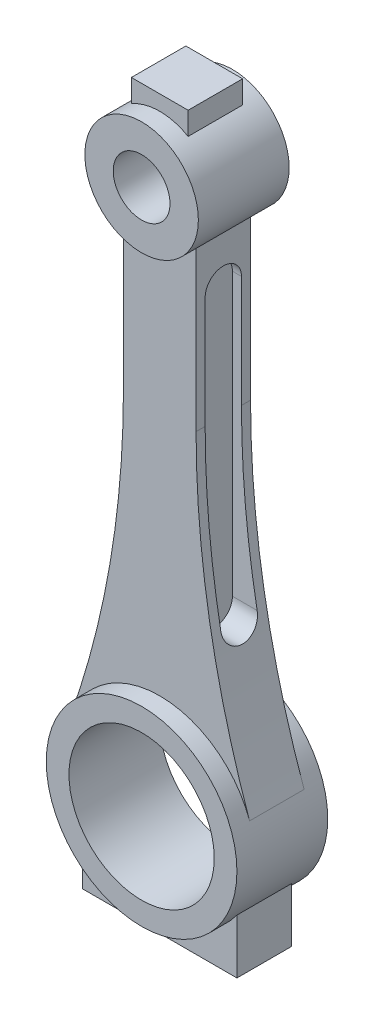
ISO-10303-21;
HEADER;
FILE_DESCRIPTION(('STEP AP214'),'2;1');
FILE_NAME('part.step','',(''),(''),'','','');
FILE_SCHEMA(('AUTOMOTIVE_DESIGN { 1 0 10303 214 1 1 1 1 }'));
ENDSEC;
DATA;
#1=APPLICATION_CONTEXT('core data for automotive mechanical design processes');
#2=APPLICATION_PROTOCOL_DEFINITION('international standard','automotive_design',2000,#1);
#3=PRODUCT_CONTEXT('',#1,'mechanical');
#4=PRODUCT('Part','Part','',(#3));
#5=PRODUCT_RELATED_PRODUCT_CATEGORY('part','',(#4));
#6=PRODUCT_DEFINITION_FORMATION('','',#4);
#7=PRODUCT_DEFINITION_CONTEXT('part definition',#1,'design');
#8=PRODUCT_DEFINITION('design','',#6,#7);
#9=PRODUCT_DEFINITION_SHAPE('','',#8);
#10=(LENGTH_UNIT() NAMED_UNIT(*) SI_UNIT(.MILLI.,.METRE.));
#11=(NAMED_UNIT(*) PLANE_ANGLE_UNIT() SI_UNIT($,.RADIAN.));
#12=(NAMED_UNIT(*) SI_UNIT($,.STERADIAN.) SOLID_ANGLE_UNIT());
#13=UNCERTAINTY_MEASURE_WITH_UNIT(LENGTH_MEASURE(1.E-05),#10,'distance_accuracy_value','');
#14=(GEOMETRIC_REPRESENTATION_CONTEXT(3) GLOBAL_UNCERTAINTY_ASSIGNED_CONTEXT((#13)) GLOBAL_UNIT_ASSIGNED_CONTEXT((#10,
#11,#12)) REPRESENTATION_CONTEXT('',''));
#15=CARTESIAN_POINT('',(0.,0.,0.));
#16=DIRECTION('',(0.,0.,1.));
#17=DIRECTION('',(1.,0.,0.));
#18=AXIS2_PLACEMENT_3D('',#15,#16,#17);
#19=CARTESIAN_POINT('',(212.132819979024,75.3953136438508,6.));
#20=DIRECTION('',(0.,0.,-1.));
#21=DIRECTION('',(-1.,0.,0.));
#22=AXIS2_PLACEMENT_3D('',#19,#20,#21);
#23=CYLINDRICAL_SURFACE('',#22,204.132819979024);
#24=CARTESIAN_POINT('',(11.4544735884215,38.,-4.00000000000001));
#25=CARTESIAN_POINT('',(11.4757515518411,37.8858086335559,-4.00000967356236));
#26=CARTESIAN_POINT('',(11.4971278489319,37.7716411229782,-3.9951101211208));
#27=CARTESIAN_POINT('',(11.5399210356049,37.544152772884,-3.97557755361705));
#28=CARTESIAN_POINT('',(11.5613379239584,37.4308319082382,-3.9609448286138));
#29=CARTESIAN_POINT('',(11.6040518019029,37.2058589467753,-3.92203609087539));
#30=CARTESIAN_POINT('',(11.6253488219803,37.0942064124742,-3.89776265395078));
#31=CARTESIAN_POINT('',(11.6676599337569,36.8733657612217,-3.83975872762631));
#32=CARTESIAN_POINT('',(11.6886740293759,36.7641776101131,-3.80602836938937));
#33=CARTESIAN_POINT('',(11.7510730473326,36.4413470108117,-3.69089420326938));
#34=CARTESIAN_POINT('',(11.7918289081029,36.2323636826891,-3.59553432969807));
#35=CARTESIAN_POINT('',(11.8702126062764,35.833491871712,-3.37027556179513));
#36=CARTESIAN_POINT('',(11.9078413597511,35.643597793309,-3.24038682968163));
#37=CARTESIAN_POINT('',(11.9784728244352,35.2894796680367,-2.950436910244));
#38=CARTESIAN_POINT('',(12.0115036519544,35.1250988255321,-2.79057453802655));
#39=CARTESIAN_POINT('',(12.0720036427705,34.8256035029566,-2.44449926104124));
#40=CARTESIAN_POINT('',(12.0994724370193,34.6904909648341,-2.25828460915733));
#41=CARTESIAN_POINT('',(12.1473413477104,34.4559602912754,-1.86832249559897));
#42=CARTESIAN_POINT('',(12.1678582991114,34.3559510460777,-1.66494499104501));
#43=CARTESIAN_POINT('',(12.201667760202,34.1915558050773,-1.24372237948288));
#44=CARTESIAN_POINT('',(12.2149615713728,34.1271633917176,-1.02587988675161));
#45=CARTESIAN_POINT('',(12.2336033492388,34.0369591960168,-0.586274812122707));
#46=CARTESIAN_POINT('',(12.2390950212481,34.0104496060439,-0.364661335561857));
#47=CARTESIAN_POINT('',(12.2423732155318,33.9946184843632,0.0799443502249413));
#48=CARTESIAN_POINT('',(12.2401601145853,34.0052951341723,0.302936491499036));
#49=CARTESIAN_POINT('',(12.2281765408432,34.0632127244266,0.741781925824315));
#50=CARTESIAN_POINT('',(12.2184766498272,34.1101121767816,0.957682365575701));
#51=CARTESIAN_POINT('',(12.1919895794175,34.2385791029979,1.37844153266758));
#52=CARTESIAN_POINT('',(12.1752023313576,34.3201469127454,1.58330015300714));
#53=CARTESIAN_POINT('',(12.1350793834177,34.5159552856904,1.977397761575));
#54=CARTESIAN_POINT('',(12.1117098081663,34.6303649264094,2.16654921549123));
#55=CARTESIAN_POINT('',(12.0593260749273,34.8882465100265,2.52297125984127));
#56=CARTESIAN_POINT('',(12.0303117725959,35.0317191961119,2.69024129055298));
#57=CARTESIAN_POINT('',(11.9671383735568,35.3461665633751,3.00114206510914));
#58=CARTESIAN_POINT('',(11.9329025496515,35.5175545383741,3.14433904981939));
#59=CARTESIAN_POINT('',(11.8607975408037,35.8812712267655,3.40006280722765));
#60=CARTESIAN_POINT('',(11.8229268395297,36.0736086840292,3.51257670427656));
#61=CARTESIAN_POINT('',(11.744011046999,36.4777513253325,3.70593438635491));
#62=CARTESIAN_POINT('',(11.7029182624971,36.6898643551292,3.78611370956408));
#63=CARTESIAN_POINT('',(11.6195357198389,37.1241795414682,3.90944320644274));
#64=CARTESIAN_POINT('',(11.5772477716993,37.3463667203578,3.95264656840454));
#65=CARTESIAN_POINT('',(11.5215540274852,37.6417241762258,3.98457340087694));
#66=CARTESIAN_POINT('',(11.5080944382148,37.713314753212,3.99036111817268));
#67=CARTESIAN_POINT('',(11.481236818834,37.8565916807734,3.99806924003837));
#68=CARTESIAN_POINT('',(11.4678387235409,37.9282776734255,3.99999606757804));
#69=CARTESIAN_POINT('',(11.4544735884215,38.,3.99999999999999));
#70=B_SPLINE_CURVE_WITH_KNOTS('',3,(#24,#25,#26,#27,#28,#29,#30,#31,#32,#33,#34,#35,#36,#37,#38,
#39,#40,#41,#42,#43,#44,#45,#46,#47,#48,#49,#50,#51,#52,#53,#54,#55,#56,#57,#58,#59,#60,#61,#62,
#63,#64,#65,#66,#67,#68,#69),.UNSPECIFIED.,.F.,.F.,(4,2,2,2,2,2,2,2,2,2,2,2,2,2,2,2,2,2,2,2,2,2,
4),(0.,0.348357600629776,0.696704820295751,1.04495903090801,1.39320841164155,2.08947857427322,
2.78554404346984,3.47714614167073,4.1687941135383,4.84816302804556,5.52740949173436,
6.19397531687089,6.86050854603356,7.52083364695975,8.18116514562694,8.84495910470898,
9.50877004017901,10.1834922182609,10.8584970981523,11.546741507572,12.2339942357506,
12.4531452672714,12.6719314158043),.UNSPECIFIED.);
#71=CARTESIAN_POINT('',(11.4544735884215,38.,-4.00000000000001));
#72=VERTEX_POINT('',#71);
#73=CARTESIAN_POINT('',(11.4544735884215,38.,3.99999999999999));
#74=VERTEX_POINT('',#73);
#75=EDGE_CURVE('E11',#72,#74,#70,.T.);
#76=ORIENTED_EDGE('',*,*,#75,.T.);
#77=CARTESIAN_POINT('',(212.132819979024,75.3953136438508,4.));
#78=DIRECTION('',(0.,0.,-1.));
#79=DIRECTION('',(0.,1.,0.));
#80=AXIS2_PLACEMENT_3D('',#77,#78,#79);
#81=CIRCLE('',#80,204.132819979024);
#82=CARTESIAN_POINT('',(8.00000000000001,75.3953136438507,4.));
#83=VERTEX_POINT('',#82);
#84=EDGE_CURVE('E252',#74,#83,#81,.T.);
#85=ORIENTED_EDGE('',*,*,#84,.T.);
#86=DIRECTION('',(0.,0.,-1.));
#87=VECTOR('',#86,1.);
#88=CARTESIAN_POINT('',(8.00000000000001,75.3953136438507,6.));
#89=LINE('',#88,#87);
#90=CARTESIAN_POINT('',(8.00000000000001,75.3953136438507,6.));
#91=VERTEX_POINT('',#90);
#92=EDGE_CURVE('E443',#91,#83,#89,.T.);
#93=ORIENTED_EDGE('',*,*,#92,.F.);
#94=CARTESIAN_POINT('',(212.132819979024,75.3953136438508,6.));
#95=DIRECTION('',(0.,0.,1.));
#96=DIRECTION('',(1.,0.,0.));
#97=AXIS2_PLACEMENT_3D('',#94,#95,#96);
#98=CIRCLE('',#97,204.132819979024);
#99=CARTESIAN_POINT('',(19.7873824881444,7.03274443356766,6.));
#100=VERTEX_POINT('',#99);
#101=EDGE_CURVE('E409',#91,#100,#98,.T.);
#102=ORIENTED_EDGE('',*,*,#101,.T.);
#103=DIRECTION('',(0.,0.,-1.));
#104=VECTOR('',#103,1.);
#105=CARTESIAN_POINT('',(19.7873824881444,7.03274443356765,6.));
#106=LINE('',#105,#104);
#107=CARTESIAN_POINT('',(19.7873824881444,7.03274443356766,-6.));
#108=VERTEX_POINT('',#107);
#109=EDGE_CURVE('E447',#100,#108,#106,.T.);
#110=ORIENTED_EDGE('',*,*,#109,.T.);
#111=CARTESIAN_POINT('',(212.132819979024,75.3953136438508,-6.));
#112=DIRECTION('',(0.,0.,1.));
#113=DIRECTION('',(1.,0.,0.));
#114=AXIS2_PLACEMENT_3D('',#111,#112,#113);
#115=CIRCLE('',#114,204.132819979024);
#116=CARTESIAN_POINT('',(8.00000000000001,75.3953136438507,-6.));
#117=VERTEX_POINT('',#116);
#118=EDGE_CURVE('E433',#117,#108,#115,.T.);
#119=ORIENTED_EDGE('',*,*,#118,.F.);
#120=CARTESIAN_POINT('',(8.00000000000001,75.3953136438507,-4.00000000000001));
#121=VERTEX_POINT('',#120);
#122=EDGE_CURVE('E442',#121,#117,#89,.T.);
#123=ORIENTED_EDGE('',*,*,#122,.F.);
#124=CARTESIAN_POINT('',(212.132819979024,75.3953136438508,-4.00000000000001));
#125=DIRECTION('',(0.,0.,1.));
#126=DIRECTION('',(0.,-1.,0.));
#127=AXIS2_PLACEMENT_3D('',#124,#125,#126);
#128=CIRCLE('',#127,204.132819979024);
#129=EDGE_CURVE('E61',#121,#72,#128,.T.);
#130=ORIENTED_EDGE('',*,*,#129,.T.);
#131=EDGE_LOOP('',(#76,#85,#93,#102,#110,#119,#123,#130));
#132=FACE_BOUND('',#131,.T.);
#133=ADVANCED_FACE('F39',(#132),#23,.F.);
#134=CARTESIAN_POINT('',(8.00000000000003,0.,6.));
#135=DIRECTION('',(-1.,0.,0.));
#136=DIRECTION('',(0.,-1.,0.));
#137=AXIS2_PLACEMENT_3D('',#134,#135,#136);
#138=PLANE('',#137);
#139=DIRECTION('',(0.,-1.,0.));
#140=VECTOR('',#139,1.);
#141=CARTESIAN_POINT('',(8.00000000000003,0.,3.99999999999999));
#142=LINE('',#141,#140);
#143=CARTESIAN_POINT('',(8.00000000000001,100.,4.));
#144=VERTEX_POINT('',#143);
#145=EDGE_CURVE('E54',#144,#83,#142,.T.);
#146=ORIENTED_EDGE('',*,*,#145,.F.);
#147=CARTESIAN_POINT('',(8.,100.,0.));
#148=DIRECTION('',(-1.,0.,0.));
#149=DIRECTION('',(0.,-1.,0.));
#150=AXIS2_PLACEMENT_3D('',#147,#148,#149);
#151=CIRCLE('',#150,4.);
#152=CARTESIAN_POINT('',(8.00000000000001,100.,-4.));
#153=VERTEX_POINT('',#152);
#154=EDGE_CURVE('E215',#153,#144,#151,.F.);
#155=ORIENTED_EDGE('',*,*,#154,.F.);
#156=DIRECTION('',(0.,1.,0.));
#157=VECTOR('',#156,1.);
#158=CARTESIAN_POINT('',(8.00000000000003,0.,-4.00000000000002));
#159=LINE('',#158,#157);
#160=EDGE_CURVE('E590',#121,#153,#159,.T.);
#161=ORIENTED_EDGE('',*,*,#160,.F.);
#162=ORIENTED_EDGE('',*,*,#122,.T.);
#163=DIRECTION('',(0.,1.,0.));
#164=VECTOR('',#163,1.);
#165=CARTESIAN_POINT('',(8.00000000000003,0.,-6.));
#166=LINE('',#165,#164);
#167=CARTESIAN_POINT('',(8.,110.395313643851,-6.));
#168=VERTEX_POINT('',#167);
#169=EDGE_CURVE('E398',#117,#168,#166,.T.);
#170=ORIENTED_EDGE('',*,*,#169,.T.);
#171=DIRECTION('',(0.,0.,-1.));
#172=VECTOR('',#171,1.);
#173=CARTESIAN_POINT('',(8.,110.395313643851,6.));
#174=LINE('',#173,#172);
#175=CARTESIAN_POINT('',(8.,110.395313643851,6.));
#176=VERTEX_POINT('',#175);
#177=EDGE_CURVE('E417',#176,#168,#174,.T.);
#178=ORIENTED_EDGE('',*,*,#177,.F.);
#179=DIRECTION('',(0.,1.,0.));
#180=VECTOR('',#179,1.);
#181=CARTESIAN_POINT('',(8.00000000000003,0.,6.));
#182=LINE('',#181,#180);
#183=EDGE_CURVE('E413',#91,#176,#182,.T.);
#184=ORIENTED_EDGE('',*,*,#183,.F.);
#185=ORIENTED_EDGE('',*,*,#92,.T.);
#186=EDGE_LOOP('',(#146,#155,#161,#162,#170,#178,#184,#185));
#187=FACE_BOUND('',#186,.T.);
#188=ADVANCED_FACE('F578',(#187),#138,.F.);
#189=CARTESIAN_POINT('',(0.,120.,10.));
#190=DIRECTION('',(0.,0.,-1.));
#191=DIRECTION('',(-1.,0.,0.));
#192=AXIS2_PLACEMENT_3D('',#189,#190,#191);
#193=CYLINDRICAL_SURFACE('',#192,6.25);
#194=CARTESIAN_POINT('',(0.,120.,10.));
#195=DIRECTION('',(0.,0.,1.));
#196=DIRECTION('',(1.,0.,0.));
#197=AXIS2_PLACEMENT_3D('',#194,#195,#196);
#198=CIRCLE('',#197,6.25);
#199=CARTESIAN_POINT('',(6.25,120.,10.));
#200=VERTEX_POINT('',#199);
#201=EDGE_CURVE('E464',#200,#200,#198,.T.);
#202=ORIENTED_EDGE('',*,*,#201,.T.);
#203=EDGE_LOOP('',(#202));
#204=FACE_BOUND('',#203,.T.);
#205=CARTESIAN_POINT('',(0.,120.,-10.));
#206=DIRECTION('',(0.,0.,1.));
#207=DIRECTION('',(1.,0.,0.));
#208=AXIS2_PLACEMENT_3D('',#205,#206,#207);
#209=CIRCLE('',#208,6.25);
#210=CARTESIAN_POINT('',(6.25,120.,-10.));
#211=VERTEX_POINT('',#210);
#212=EDGE_CURVE('E463',#211,#211,#209,.T.);
#213=ORIENTED_EDGE('',*,*,#212,.F.);
#214=EDGE_LOOP('',(#213));
#215=FACE_BOUND('',#214,.T.);
#216=ADVANCED_FACE('F41',(#204,#215),#193,.F.);
#217=CARTESIAN_POINT('',(0.,120.,10.));
#218=DIRECTION('',(0.,0.,-1.));
#219=DIRECTION('',(-1.,0.,0.));
#220=AXIS2_PLACEMENT_3D('',#217,#218,#219);
#221=CYLINDRICAL_SURFACE('',#220,12.5);
#222=DIRECTION('',(0.,0.,-1.));
#223=VECTOR('',#222,1.);
#224=CARTESIAN_POINT('',(6.25,130.825317547305,6.));
#225=LINE('',#224,#223);
#226=CARTESIAN_POINT('',(6.25,130.825317547305,6.));
#227=VERTEX_POINT('',#226);
#228=CARTESIAN_POINT('',(6.25,130.825317547305,-6.));
#229=VERTEX_POINT('',#228);
#230=EDGE_CURVE('E373',#227,#229,#225,.T.);
#231=ORIENTED_EDGE('',*,*,#230,.F.);
#232=CARTESIAN_POINT('',(0.,120.,6.));
#233=DIRECTION('',(0.,0.,1.));
#234=DIRECTION('',(1.,0.,0.));
#235=AXIS2_PLACEMENT_3D('',#232,#233,#234);
#236=CIRCLE('',#235,12.5);
#237=CARTESIAN_POINT('',(-6.25,130.825317547305,6.));
#238=VERTEX_POINT('',#237);
#239=EDGE_CURVE('E334',#227,#238,#236,.T.);
#240=ORIENTED_EDGE('',*,*,#239,.T.);
#241=DIRECTION('',(0.,0.,-1.));
#242=VECTOR('',#241,1.);
#243=CARTESIAN_POINT('',(-6.25,130.825317547305,6.));
#244=LINE('',#243,#242);
#245=CARTESIAN_POINT('',(-6.25,130.825317547305,-6.));
#246=VERTEX_POINT('',#245);
#247=EDGE_CURVE('E350',#238,#246,#244,.T.);
#248=ORIENTED_EDGE('',*,*,#247,.T.);
#249=CARTESIAN_POINT('',(0.,120.,-6.));
#250=DIRECTION('',(0.,0.,1.));
#251=DIRECTION('',(1.,0.,0.));
#252=AXIS2_PLACEMENT_3D('',#249,#250,#251);
#253=CIRCLE('',#252,12.5);
#254=EDGE_CURVE('E333',#229,#246,#253,.T.);
#255=ORIENTED_EDGE('',*,*,#254,.F.);
#256=EDGE_LOOP('',(#231,#240,#248,#255));
#257=FACE_BOUND('',#256,.T.);
#258=DIRECTION('',(0.,0.,-1.));
#259=VECTOR('',#258,1.);
#260=CARTESIAN_POINT('',(-7.99999999999999,110.395313643851,6.));
#261=LINE('',#260,#259);
#262=CARTESIAN_POINT('',(-7.99999999999999,110.395313643851,6.));
#263=VERTEX_POINT('',#262);
#264=CARTESIAN_POINT('',(-7.99999999999999,110.395313643851,-6.));
#265=VERTEX_POINT('',#264);
#266=EDGE_CURVE('E459',#263,#265,#261,.T.);
#267=ORIENTED_EDGE('',*,*,#266,.F.);
#268=CARTESIAN_POINT('',(0.,120.,6.));
#269=DIRECTION('',(0.,0.,1.));
#270=DIRECTION('',(1.,0.,0.));
#271=AXIS2_PLACEMENT_3D('',#268,#269,#270);
#272=CIRCLE('',#271,12.5);
#273=EDGE_CURVE('E394',#263,#176,#272,.T.);
#274=ORIENTED_EDGE('',*,*,#273,.T.);
#275=ORIENTED_EDGE('',*,*,#177,.T.);
#276=CARTESIAN_POINT('',(0.,120.,-6.));
#277=DIRECTION('',(0.,0.,1.));
#278=DIRECTION('',(1.,0.,0.));
#279=AXIS2_PLACEMENT_3D('',#276,#277,#278);
#280=CIRCLE('',#279,12.5);
#281=EDGE_CURVE('E387',#265,#168,#280,.T.);
#282=ORIENTED_EDGE('',*,*,#281,.F.);
#283=EDGE_LOOP('',(#267,#274,#275,#282));
#284=FACE_BOUND('',#283,.T.);
#285=CARTESIAN_POINT('',(0.,120.,10.));
#286=DIRECTION('',(0.,0.,1.));
#287=DIRECTION('',(1.,0.,0.));
#288=AXIS2_PLACEMENT_3D('',#285,#286,#287);
#289=CIRCLE('',#288,12.5);
#290=CARTESIAN_POINT('',(12.5,120.,10.));
#291=VERTEX_POINT('',#290);
#292=EDGE_CURVE('E468',#291,#291,#289,.T.);
#293=ORIENTED_EDGE('',*,*,#292,.F.);
#294=EDGE_LOOP('',(#293));
#295=FACE_BOUND('',#294,.T.);
#296=CARTESIAN_POINT('',(0.,120.,-10.));
#297=DIRECTION('',(0.,0.,1.));
#298=DIRECTION('',(1.,0.,0.));
#299=AXIS2_PLACEMENT_3D('',#296,#297,#298);
#300=CIRCLE('',#299,12.5);
#301=CARTESIAN_POINT('',(12.5,120.,-10.));
#302=VERTEX_POINT('',#301);
#303=EDGE_CURVE('E469',#302,#302,#300,.T.);
#304=ORIENTED_EDGE('',*,*,#303,.T.);
#305=EDGE_LOOP('',(#304));
#306=FACE_BOUND('',#305,.T.);
#307=ADVANCED_FACE('F864',(#257,#284,#295,#306),#221,.T.);
#308=CARTESIAN_POINT('',(0.,0.,10.));
#309=DIRECTION('',(0.,0.,1.));
#310=DIRECTION('',(1.,0.,0.));
#311=AXIS2_PLACEMENT_3D('',#308,#309,#310);
#312=PLANE('',#311);
#313=ORIENTED_EDGE('',*,*,#201,.F.);
#314=EDGE_LOOP('',(#313));
#315=FACE_BOUND('',#314,.T.);
#316=ORIENTED_EDGE('',*,*,#292,.T.);
#317=EDGE_LOOP('',(#316));
#318=FACE_BOUND('',#317,.T.);
#319=ADVANCED_FACE('F852',(#315,#318),#312,.T.);
#320=CARTESIAN_POINT('',(0.,0.,-10.));
#321=DIRECTION('',(0.,0.,1.));
#322=DIRECTION('',(1.,0.,0.));
#323=AXIS2_PLACEMENT_3D('',#320,#321,#322);
#324=PLANE('',#323);
#325=ORIENTED_EDGE('',*,*,#212,.T.);
#326=EDGE_LOOP('',(#325));
#327=FACE_BOUND('',#326,.T.);
#328=ORIENTED_EDGE('',*,*,#303,.F.);
#329=EDGE_LOOP('',(#328));
#330=FACE_BOUND('',#329,.T.);
#331=ADVANCED_FACE('F728',(#327,#330),#324,.F.);
#332=CARTESIAN_POINT('',(-7.99999999999999,0.,6.));
#333=DIRECTION('',(-1.,0.,0.));
#334=DIRECTION('',(0.,0.,1.));
#335=AXIS2_PLACEMENT_3D('',#332,#333,#334);
#336=PLANE('',#335);
#337=DIRECTION('',(0.,-1.,0.));
#338=VECTOR('',#337,1.);
#339=CARTESIAN_POINT('',(-7.99999999999999,0.,-4.00000000000002));
#340=LINE('',#339,#338);
#341=CARTESIAN_POINT('',(-8.,100.,-4.));
#342=VERTEX_POINT('',#341);
#343=CARTESIAN_POINT('',(-7.99999999999995,75.3953136438507,-4.00000000000001));
#344=VERTEX_POINT('',#343);
#345=EDGE_CURVE('E285',#342,#344,#340,.T.);
#346=ORIENTED_EDGE('',*,*,#345,.F.);
#347=CARTESIAN_POINT('',(-7.99999999999999,100.,0.));
#348=DIRECTION('',(-1.,0.,0.));
#349=DIRECTION('',(0.,0.,1.));
#350=AXIS2_PLACEMENT_3D('',#347,#348,#349);
#351=CIRCLE('',#350,4.);
#352=CARTESIAN_POINT('',(-8.,100.,4.));
#353=VERTEX_POINT('',#352);
#354=EDGE_CURVE('E595',#353,#342,#351,.T.);
#355=ORIENTED_EDGE('',*,*,#354,.F.);
#356=DIRECTION('',(0.,1.,0.));
#357=VECTOR('',#356,1.);
#358=CARTESIAN_POINT('',(-7.99999999999999,0.,3.99999999999999));
#359=LINE('',#358,#357);
#360=CARTESIAN_POINT('',(-7.99999999999995,75.3953136438507,4.));
#361=VERTEX_POINT('',#360);
#362=EDGE_CURVE('E275',#361,#353,#359,.T.);
#363=ORIENTED_EDGE('',*,*,#362,.F.);
#364=DIRECTION('',(0.,0.,-1.));
#365=VECTOR('',#364,1.);
#366=CARTESIAN_POINT('',(-7.99999999999999,75.3953136438507,6.));
#367=LINE('',#366,#365);
#368=CARTESIAN_POINT('',(-7.99999999999999,75.3953136438507,6.));
#369=VERTEX_POINT('',#368);
#370=EDGE_CURVE('E455',#369,#361,#367,.T.);
#371=ORIENTED_EDGE('',*,*,#370,.F.);
#372=DIRECTION('',(0.,1.,0.));
#373=VECTOR('',#372,1.);
#374=CARTESIAN_POINT('',(-7.99999999999999,0.,6.));
#375=LINE('',#374,#373);
#376=EDGE_CURVE('E397',#369,#263,#375,.T.);
#377=ORIENTED_EDGE('',*,*,#376,.T.);
#378=ORIENTED_EDGE('',*,*,#266,.T.);
#379=DIRECTION('',(0.,1.,0.));
#380=VECTOR('',#379,1.);
#381=CARTESIAN_POINT('',(-7.99999999999999,0.,-6.));
#382=LINE('',#381,#380);
#383=CARTESIAN_POINT('',(-7.99999999999999,75.3953136438507,-6.));
#384=VERTEX_POINT('',#383);
#385=EDGE_CURVE('E421',#384,#265,#382,.T.);
#386=ORIENTED_EDGE('',*,*,#385,.F.);
#387=EDGE_CURVE('E454',#344,#384,#367,.T.);
#388=ORIENTED_EDGE('',*,*,#387,.F.);
#389=EDGE_LOOP('',(#346,#355,#363,#371,#377,#378,#386,#388));
#390=FACE_BOUND('',#389,.T.);
#391=ADVANCED_FACE('F611',(#390),#336,.T.);
#392=CARTESIAN_POINT('',(-212.132819979024,75.3953136438507,6.));
#393=DIRECTION('',(0.,0.,-1.));
#394=DIRECTION('',(-1.,0.,0.));
#395=AXIS2_PLACEMENT_3D('',#392,#393,#394);
#396=CYLINDRICAL_SURFACE('',#395,204.132819979024);
#397=CARTESIAN_POINT('',(-11.4544735884215,38.,3.99999999999999));
#398=CARTESIAN_POINT('',(-11.4757515518411,37.8858086335559,4.00000967356234));
#399=CARTESIAN_POINT('',(-11.497127848932,37.7716411229782,3.99511012112078));
#400=CARTESIAN_POINT('',(-11.5399210356049,37.544152772884,3.97557755361703));
#401=CARTESIAN_POINT('',(-11.5613379239584,37.4308319082382,3.96094482861378));
#402=CARTESIAN_POINT('',(-11.6040518019029,37.2058589467753,3.92203609087537));
#403=CARTESIAN_POINT('',(-11.6253488219802,37.0942064124742,3.89776265395076));
#404=CARTESIAN_POINT('',(-11.6676599337569,36.8733657612217,3.83975872762629));
#405=CARTESIAN_POINT('',(-11.6886740293759,36.7641776101131,3.80602836938935));
#406=CARTESIAN_POINT('',(-11.7510730473326,36.4413470108117,3.69089420326936));
#407=CARTESIAN_POINT('',(-11.7918289081029,36.2323636826891,3.59553432969806));
#408=CARTESIAN_POINT('',(-11.8702126062764,35.833491871712,3.37027556179512));
#409=CARTESIAN_POINT('',(-11.9078413597511,35.643597793309,3.24038682968161));
#410=CARTESIAN_POINT('',(-11.9784728244352,35.2894796680367,2.95043691024398));
#411=CARTESIAN_POINT('',(-12.0115036519544,35.1250988255321,2.79057453802653));
#412=CARTESIAN_POINT('',(-12.0720036427705,34.8256035029566,2.44449926104122));
#413=CARTESIAN_POINT('',(-12.0994724370193,34.6904909648341,2.25828460915731));
#414=CARTESIAN_POINT('',(-12.1473413477104,34.4559602912754,1.86832249559894));
#415=CARTESIAN_POINT('',(-12.1678582991115,34.3559510460777,1.66494499104499));
#416=CARTESIAN_POINT('',(-12.201667760202,34.1915558050773,1.24372237948285));
#417=CARTESIAN_POINT('',(-12.2149615713728,34.1271633917176,1.02587988675158));
#418=CARTESIAN_POINT('',(-12.2336033492387,34.0369591960168,0.586274812122681));
#419=CARTESIAN_POINT('',(-12.2390950212481,34.0104496060439,0.364661335561831));
#420=CARTESIAN_POINT('',(-12.2423732155318,33.9946184843632,-0.0799443502249659));
#421=CARTESIAN_POINT('',(-12.2401601145852,34.0052951341723,-0.302936491499059));
#422=CARTESIAN_POINT('',(-12.2281765408432,34.0632127244266,-0.74178192582434));
#423=CARTESIAN_POINT('',(-12.2184766498272,34.1101121767816,-0.957682365575728));
#424=CARTESIAN_POINT('',(-12.1919895794175,34.2385791029979,-1.37844153266761));
#425=CARTESIAN_POINT('',(-12.1752023313576,34.3201469127454,-1.58330015300717));
#426=CARTESIAN_POINT('',(-12.1350793834177,34.5159552856904,-1.97739776157503));
#427=CARTESIAN_POINT('',(-12.1117098081663,34.6303649264094,-2.16654921549125));
#428=CARTESIAN_POINT('',(-12.0593260749272,34.8882465100265,-2.52297125984129));
#429=CARTESIAN_POINT('',(-12.0303117725959,35.0317191961119,-2.69024129055301));
#430=CARTESIAN_POINT('',(-11.9671383735568,35.3461665633751,-3.00114206510916));
#431=CARTESIAN_POINT('',(-11.9329025496515,35.5175545383741,-3.14433904981941));
#432=CARTESIAN_POINT('',(-11.8607975408037,35.8812712267655,-3.40006280722767));
#433=CARTESIAN_POINT('',(-11.8229268395297,36.0736086840292,-3.51257670427658));
#434=CARTESIAN_POINT('',(-11.744011046999,36.4777513253325,-3.70593438635493));
#435=CARTESIAN_POINT('',(-11.702918262497,36.6898643551292,-3.7861137095641));
#436=CARTESIAN_POINT('',(-11.6195357198389,37.1241795414682,-3.90944320644276));
#437=CARTESIAN_POINT('',(-11.5772477716993,37.3463667203578,-3.95264656840457));
#438=CARTESIAN_POINT('',(-11.5215540274852,37.6417241762258,-3.98457340087696));
#439=CARTESIAN_POINT('',(-11.5080944382148,37.7133147532121,-3.9903611181727));
#440=CARTESIAN_POINT('',(-11.481236818834,37.8565916807734,-3.99806924003839));
#441=CARTESIAN_POINT('',(-11.4678387235409,37.9282776734255,-3.99999606757806));
#442=CARTESIAN_POINT('',(-11.4544735884215,38.,-4.00000000000001));
#443=B_SPLINE_CURVE_WITH_KNOTS('',3,(#397,#398,#399,#400,#401,#402,#403,#404,#405,#406,#407,
#408,#409,#410,#411,#412,#413,#414,#415,#416,#417,#418,#419,#420,#421,#422,#423,#424,#425,#426,
#427,#428,#429,#430,#431,#432,#433,#434,#435,#436,#437,#438,#439,#440,#441,#442),.UNSPECIFIED.,
.F.,.F.,(4,2,2,2,2,2,2,2,2,2,2,2,2,2,2,2,2,2,2,2,2,2,4),(0.,0.348357600629778,0.696704820295753,
1.04495903090801,1.39320841164155,2.08947857427321,2.78554404346984,3.47714614167073,
4.16879411353831,4.84816302804556,5.52740949173436,6.1939753168709,6.86050854603357,
7.52083364695976,8.18116514562695,8.84495910470898,9.50877004017902,10.1834922182609,
10.8584970981523,11.546741507572,12.2339942357506,12.4531452672714,12.6719314158043),.UNSPECIFIED.);
#444=CARTESIAN_POINT('',(-11.4544735884215,38.,3.99999999999999));
#445=VERTEX_POINT('',#444);
#446=CARTESIAN_POINT('',(-11.4544735884215,38.,-4.00000000000001));
#447=VERTEX_POINT('',#446);
#448=EDGE_CURVE('E483',#445,#447,#443,.T.);
#449=ORIENTED_EDGE('',*,*,#448,.T.);
#450=CARTESIAN_POINT('',(-212.132819979024,75.3953136438507,-4.00000000000001));
#451=DIRECTION('',(0.,0.,-1.));
#452=DIRECTION('',(0.,1.,0.));
#453=AXIS2_PLACEMENT_3D('',#450,#451,#452);
#454=CIRCLE('',#453,204.132819979024);
#455=EDGE_CURVE('E493',#447,#344,#454,.F.);
#456=ORIENTED_EDGE('',*,*,#455,.T.);
#457=ORIENTED_EDGE('',*,*,#387,.T.);
#458=CARTESIAN_POINT('',(-212.132819979024,75.3953136438507,-6.));
#459=DIRECTION('',(0.,0.,1.));
#460=DIRECTION('',(1.,0.,0.));
#461=AXIS2_PLACEMENT_3D('',#458,#459,#460);
#462=CIRCLE('',#461,204.132819979024);
#463=CARTESIAN_POINT('',(-19.7873824881444,7.03274443356764,-6.));
#464=VERTEX_POINT('',#463);
#465=EDGE_CURVE('E425',#384,#464,#462,.F.);
#466=ORIENTED_EDGE('',*,*,#465,.T.);
#467=DIRECTION('',(0.,0.,-1.));
#468=VECTOR('',#467,1.);
#469=CARTESIAN_POINT('',(-19.7873824881444,7.03274443356764,6.));
#470=LINE('',#469,#468);
#471=CARTESIAN_POINT('',(-19.7873824881444,7.03274443356764,6.));
#472=VERTEX_POINT('',#471);
#473=EDGE_CURVE('E451',#472,#464,#470,.T.);
#474=ORIENTED_EDGE('',*,*,#473,.F.);
#475=CARTESIAN_POINT('',(-212.132819979024,75.3953136438507,6.));
#476=DIRECTION('',(0.,0.,1.));
#477=DIRECTION('',(1.,0.,0.));
#478=AXIS2_PLACEMENT_3D('',#475,#476,#477);
#479=CIRCLE('',#478,204.132819979024);
#480=EDGE_CURVE('E402',#369,#472,#479,.F.);
#481=ORIENTED_EDGE('',*,*,#480,.F.);
#482=ORIENTED_EDGE('',*,*,#370,.T.);
#483=CARTESIAN_POINT('',(-212.132819979024,75.3953136438507,4.));
#484=DIRECTION('',(0.,0.,1.));
#485=DIRECTION('',(0.,-1.,0.));
#486=AXIS2_PLACEMENT_3D('',#483,#484,#485);
#487=CIRCLE('',#486,204.132819979024);
#488=EDGE_CURVE('E473',#361,#445,#487,.F.);
#489=ORIENTED_EDGE('',*,*,#488,.T.);
#490=EDGE_LOOP('',(#449,#456,#457,#466,#474,#481,#482,#489));
#491=FACE_BOUND('',#490,.T.);
#492=ADVANCED_FACE('F495',(#491),#396,.F.);
#493=CARTESIAN_POINT('',(0.,0.,6.));
#494=DIRECTION('',(0.,0.,1.));
#495=DIRECTION('',(1.,0.,0.));
#496=AXIS2_PLACEMENT_3D('',#493,#494,#495);
#497=PLANE('',#496);
#498=ORIENTED_EDGE('',*,*,#273,.F.);
#499=ORIENTED_EDGE('',*,*,#376,.F.);
#500=ORIENTED_EDGE('',*,*,#480,.T.);
#501=CARTESIAN_POINT('',(0.,0.,6.));
#502=DIRECTION('',(0.,0.,1.));
#503=DIRECTION('',(1.,0.,0.));
#504=AXIS2_PLACEMENT_3D('',#501,#502,#503);
#505=CIRCLE('',#504,21.);
#506=EDGE_CURVE('E406',#100,#472,#505,.T.);
#507=ORIENTED_EDGE('',*,*,#506,.F.);
#508=ORIENTED_EDGE('',*,*,#101,.F.);
#509=ORIENTED_EDGE('',*,*,#183,.T.);
#510=EDGE_LOOP('',(#498,#499,#500,#507,#508,#509));
#511=FACE_BOUND('',#510,.T.);
#512=ADVANCED_FACE('F571',(#511),#497,.T.);
#513=CARTESIAN_POINT('',(0.,0.,-6.));
#514=DIRECTION('',(0.,0.,1.));
#515=DIRECTION('',(1.,0.,0.));
#516=AXIS2_PLACEMENT_3D('',#513,#514,#515);
#517=PLANE('',#516);
#518=ORIENTED_EDGE('',*,*,#281,.T.);
#519=ORIENTED_EDGE('',*,*,#169,.F.);
#520=ORIENTED_EDGE('',*,*,#118,.T.);
#521=CARTESIAN_POINT('',(0.,0.,-6.));
#522=DIRECTION('',(0.,0.,1.));
#523=DIRECTION('',(1.,0.,0.));
#524=AXIS2_PLACEMENT_3D('',#521,#522,#523);
#525=CIRCLE('',#524,21.);
#526=EDGE_CURVE('E429',#108,#464,#525,.T.);
#527=ORIENTED_EDGE('',*,*,#526,.T.);
#528=ORIENTED_EDGE('',*,*,#465,.F.);
#529=ORIENTED_EDGE('',*,*,#385,.T.);
#530=EDGE_LOOP('',(#518,#519,#520,#527,#528,#529));
#531=FACE_BOUND('',#530,.T.);
#532=ADVANCED_FACE('F569',(#531),#517,.F.);
#533=CARTESIAN_POINT('',(0.,0.,10.));
#534=DIRECTION('',(0.,0.,-1.));
#535=DIRECTION('',(-1.,0.,0.));
#536=AXIS2_PLACEMENT_3D('',#533,#534,#535);
#537=CYLINDRICAL_SURFACE('',#536,16.);
#538=CARTESIAN_POINT('',(0.,0.,10.));
#539=DIRECTION('',(0.,0.,1.));
#540=DIRECTION('',(1.,0.,0.));
#541=AXIS2_PLACEMENT_3D('',#538,#539,#540);
#542=CIRCLE('',#541,16.);
#543=CARTESIAN_POINT('',(16.,0.,10.));
#544=VERTEX_POINT('',#543);
#545=EDGE_CURVE('E378',#544,#544,#542,.T.);
#546=ORIENTED_EDGE('',*,*,#545,.T.);
#547=EDGE_LOOP('',(#546));
#548=FACE_BOUND('',#547,.T.);
#549=CARTESIAN_POINT('',(0.,0.,-10.));
#550=DIRECTION('',(0.,0.,1.));
#551=DIRECTION('',(1.,0.,0.));
#552=AXIS2_PLACEMENT_3D('',#549,#550,#551);
#553=CIRCLE('',#552,16.);
#554=CARTESIAN_POINT('',(16.,0.,-10.));
#555=VERTEX_POINT('',#554);
#556=EDGE_CURVE('E377',#555,#555,#553,.T.);
#557=ORIENTED_EDGE('',*,*,#556,.F.);
#558=EDGE_LOOP('',(#557));
#559=FACE_BOUND('',#558,.T.);
#560=ADVANCED_FACE('F565',(#548,#559),#537,.F.);
#561=CARTESIAN_POINT('',(0.,0.,10.));
#562=DIRECTION('',(0.,0.,-1.));
#563=DIRECTION('',(-1.,0.,0.));
#564=AXIS2_PLACEMENT_3D('',#561,#562,#563);
#565=CYLINDRICAL_SURFACE('',#564,21.);
#566=DIRECTION('',(0.,0.,-1.));
#567=VECTOR('',#566,1.);
#568=CARTESIAN_POINT('',(-17.,-12.328828005938,6.));
#569=LINE('',#568,#567);
#570=CARTESIAN_POINT('',(-17.,-12.328828005938,6.));
#571=VERTEX_POINT('',#570);
#572=CARTESIAN_POINT('',(-17.,-12.328828005938,-6.));
#573=VERTEX_POINT('',#572);
#574=EDGE_CURVE('E322',#571,#573,#569,.T.);
#575=ORIENTED_EDGE('',*,*,#574,.F.);
#576=CARTESIAN_POINT('',(0.,0.,6.));
#577=DIRECTION('',(0.,0.,1.));
#578=DIRECTION('',(1.,0.,0.));
#579=AXIS2_PLACEMENT_3D('',#576,#577,#578);
#580=CIRCLE('',#579,21.);
#581=CARTESIAN_POINT('',(17.,-12.3288280059379,6.));
#582=VERTEX_POINT('',#581);
#583=EDGE_CURVE('E298',#571,#582,#580,.T.);
#584=ORIENTED_EDGE('',*,*,#583,.T.);
#585=DIRECTION('',(0.,0.,-1.));
#586=VECTOR('',#585,1.);
#587=CARTESIAN_POINT('',(17.,-12.328828005938,6.));
#588=LINE('',#587,#586);
#589=CARTESIAN_POINT('',(17.,-12.328828005938,-6.));
#590=VERTEX_POINT('',#589);
#591=EDGE_CURVE('E326',#582,#590,#588,.T.);
#592=ORIENTED_EDGE('',*,*,#591,.T.);
#593=CARTESIAN_POINT('',(0.,0.,-6.));
#594=DIRECTION('',(0.,0.,1.));
#595=DIRECTION('',(1.,0.,0.));
#596=AXIS2_PLACEMENT_3D('',#593,#594,#595);
#597=CIRCLE('',#596,21.);
#598=EDGE_CURVE('E313',#573,#590,#597,.T.);
#599=ORIENTED_EDGE('',*,*,#598,.F.);
#600=EDGE_LOOP('',(#575,#584,#592,#599));
#601=FACE_BOUND('',#600,.T.);
#602=ORIENTED_EDGE('',*,*,#506,.T.);
#603=ORIENTED_EDGE('',*,*,#473,.T.);
#604=ORIENTED_EDGE('',*,*,#526,.F.);
#605=ORIENTED_EDGE('',*,*,#109,.F.);
#606=EDGE_LOOP('',(#602,#603,#604,#605));
#607=FACE_BOUND('',#606,.T.);
#608=CARTESIAN_POINT('',(0.,0.,10.));
#609=DIRECTION('',(0.,0.,1.));
#610=DIRECTION('',(1.,0.,0.));
#611=AXIS2_PLACEMENT_3D('',#608,#609,#610);
#612=CIRCLE('',#611,21.);
#613=CARTESIAN_POINT('',(21.,0.,10.));
#614=VERTEX_POINT('',#613);
#615=EDGE_CURVE('E382',#614,#614,#612,.T.);
#616=ORIENTED_EDGE('',*,*,#615,.F.);
#617=EDGE_LOOP('',(#616));
#618=FACE_BOUND('',#617,.T.);
#619=CARTESIAN_POINT('',(0.,0.,-10.));
#620=DIRECTION('',(0.,0.,1.));
#621=DIRECTION('',(1.,0.,0.));
#622=AXIS2_PLACEMENT_3D('',#619,#620,#621);
#623=CIRCLE('',#622,21.);
#624=CARTESIAN_POINT('',(21.,0.,-10.));
#625=VERTEX_POINT('',#624);
#626=EDGE_CURVE('E383',#625,#625,#623,.T.);
#627=ORIENTED_EDGE('',*,*,#626,.T.);
#628=EDGE_LOOP('',(#627));
#629=FACE_BOUND('',#628,.T.);
#630=ADVANCED_FACE('F558',(#601,#607,#618,#629),#565,.T.);
#631=CARTESIAN_POINT('',(0.,0.,10.));
#632=DIRECTION('',(0.,0.,1.));
#633=DIRECTION('',(1.,0.,0.));
#634=AXIS2_PLACEMENT_3D('',#631,#632,#633);
#635=PLANE('',#634);
#636=ORIENTED_EDGE('',*,*,#545,.F.);
#637=EDGE_LOOP('',(#636));
#638=FACE_BOUND('',#637,.T.);
#639=ORIENTED_EDGE('',*,*,#615,.T.);
#640=EDGE_LOOP('',(#639));
#641=FACE_BOUND('',#640,.T.);
#642=ADVANCED_FACE('F555',(#638,#641),#635,.T.);
#643=CARTESIAN_POINT('',(0.,0.,-10.));
#644=DIRECTION('',(0.,0.,1.));
#645=DIRECTION('',(1.,0.,0.));
#646=AXIS2_PLACEMENT_3D('',#643,#644,#645);
#647=PLANE('',#646);
#648=ORIENTED_EDGE('',*,*,#556,.T.);
#649=EDGE_LOOP('',(#648));
#650=FACE_BOUND('',#649,.T.);
#651=ORIENTED_EDGE('',*,*,#626,.F.);
#652=EDGE_LOOP('',(#651));
#653=FACE_BOUND('',#652,.T.);
#654=ADVANCED_FACE('F553',(#650,#653),#647,.F.);
#655=CARTESIAN_POINT('',(6.25000000000005,0.,6.));
#656=DIRECTION('',(1.,0.,0.));
#657=DIRECTION('',(0.,1.,0.));
#658=AXIS2_PLACEMENT_3D('',#655,#656,#657);
#659=PLANE('',#658);
#660=DIRECTION('',(0.,-1.,0.));
#661=VECTOR('',#660,1.);
#662=CARTESIAN_POINT('',(6.25000000000005,0.,-6.));
#663=LINE('',#662,#661);
#664=CARTESIAN_POINT('',(6.25,135.825317547305,-6.));
#665=VERTEX_POINT('',#664);
#666=EDGE_CURVE('E354',#665,#229,#663,.T.);
#667=ORIENTED_EDGE('',*,*,#666,.F.);
#668=DIRECTION('',(0.,0.,-1.));
#669=VECTOR('',#668,1.);
#670=CARTESIAN_POINT('',(6.25,135.825317547305,6.));
#671=LINE('',#670,#669);
#672=CARTESIAN_POINT('',(6.25,135.825317547305,6.));
#673=VERTEX_POINT('',#672);
#674=EDGE_CURVE('E370',#673,#665,#671,.T.);
#675=ORIENTED_EDGE('',*,*,#674,.F.);
#676=DIRECTION('',(0.,-1.,0.));
#677=VECTOR('',#676,1.);
#678=CARTESIAN_POINT('',(6.25000000000005,0.,6.));
#679=LINE('',#678,#677);
#680=EDGE_CURVE('E337',#673,#227,#679,.T.);
#681=ORIENTED_EDGE('',*,*,#680,.T.);
#682=ORIENTED_EDGE('',*,*,#230,.T.);
#683=EDGE_LOOP('',(#667,#675,#681,#682));
#684=FACE_BOUND('',#683,.T.);
#685=ADVANCED_FACE('F549',(#684),#659,.T.);
#686=CARTESIAN_POINT('',(0.,135.825317547305,6.));
#687=DIRECTION('',(0.,1.,0.));
#688=DIRECTION('',(0.,0.,1.));
#689=AXIS2_PLACEMENT_3D('',#686,#687,#688);
#690=PLANE('',#689);
#691=DIRECTION('',(1.,0.,0.));
#692=VECTOR('',#691,1.);
#693=CARTESIAN_POINT('',(0.,135.825317547305,-6.));
#694=LINE('',#693,#692);
#695=CARTESIAN_POINT('',(-6.25,135.825317547305,-6.));
#696=VERTEX_POINT('',#695);
#697=EDGE_CURVE('E358',#696,#665,#694,.T.);
#698=ORIENTED_EDGE('',*,*,#697,.F.);
#699=DIRECTION('',(0.,0.,-1.));
#700=VECTOR('',#699,1.);
#701=CARTESIAN_POINT('',(-6.25,135.825317547305,6.));
#702=LINE('',#701,#700);
#703=CARTESIAN_POINT('',(-6.25,135.825317547305,6.));
#704=VERTEX_POINT('',#703);
#705=EDGE_CURVE('E367',#704,#696,#702,.T.);
#706=ORIENTED_EDGE('',*,*,#705,.F.);
#707=DIRECTION('',(1.,0.,0.));
#708=VECTOR('',#707,1.);
#709=CARTESIAN_POINT('',(0.,135.825317547305,6.));
#710=LINE('',#709,#708);
#711=EDGE_CURVE('E342',#704,#673,#710,.T.);
#712=ORIENTED_EDGE('',*,*,#711,.T.);
#713=ORIENTED_EDGE('',*,*,#674,.T.);
#714=EDGE_LOOP('',(#698,#706,#712,#713));
#715=FACE_BOUND('',#714,.T.);
#716=ADVANCED_FACE('F545',(#715),#690,.T.);
#717=CARTESIAN_POINT('',(-6.24999999999996,0.,6.));
#718=DIRECTION('',(1.,0.,0.));
#719=DIRECTION('',(0.,1.,0.));
#720=AXIS2_PLACEMENT_3D('',#717,#718,#719);
#721=PLANE('',#720);
#722=DIRECTION('',(0.,-1.,0.));
#723=VECTOR('',#722,1.);
#724=CARTESIAN_POINT('',(-6.24999999999996,0.,-6.));
#725=LINE('',#724,#723);
#726=EDGE_CURVE('E338',#696,#246,#725,.T.);
#727=ORIENTED_EDGE('',*,*,#726,.T.);
#728=ORIENTED_EDGE('',*,*,#247,.F.);
#729=DIRECTION('',(0.,-1.,0.));
#730=VECTOR('',#729,1.);
#731=CARTESIAN_POINT('',(-6.24999999999996,0.,6.));
#732=LINE('',#731,#730);
#733=EDGE_CURVE('E346',#704,#238,#732,.T.);
#734=ORIENTED_EDGE('',*,*,#733,.F.);
#735=ORIENTED_EDGE('',*,*,#705,.T.);
#736=EDGE_LOOP('',(#727,#728,#734,#735));
#737=FACE_BOUND('',#736,.T.);
#738=ADVANCED_FACE('F538',(#737),#721,.F.);
#739=CARTESIAN_POINT('',(0.,0.,6.));
#740=DIRECTION('',(0.,0.,1.));
#741=DIRECTION('',(1.,0.,0.));
#742=AXIS2_PLACEMENT_3D('',#739,#740,#741);
#743=PLANE('',#742);
#744=ORIENTED_EDGE('',*,*,#239,.F.);
#745=ORIENTED_EDGE('',*,*,#680,.F.);
#746=ORIENTED_EDGE('',*,*,#711,.F.);
#747=ORIENTED_EDGE('',*,*,#733,.T.);
#748=EDGE_LOOP('',(#744,#745,#746,#747));
#749=FACE_BOUND('',#748,.T.);
#750=ADVANCED_FACE('F535',(#749),#743,.T.);
#751=CARTESIAN_POINT('',(0.,0.,-6.));
#752=DIRECTION('',(0.,0.,1.));
#753=DIRECTION('',(1.,0.,0.));
#754=AXIS2_PLACEMENT_3D('',#751,#752,#753);
#755=PLANE('',#754);
#756=ORIENTED_EDGE('',*,*,#254,.T.);
#757=ORIENTED_EDGE('',*,*,#726,.F.);
#758=ORIENTED_EDGE('',*,*,#697,.T.);
#759=ORIENTED_EDGE('',*,*,#666,.T.);
#760=EDGE_LOOP('',(#756,#757,#758,#759));
#761=FACE_BOUND('',#760,.T.);
#762=ADVANCED_FACE('F533',(#761),#755,.F.);
#763=CARTESIAN_POINT('',(0.,-24.328828005938,6.));
#764=DIRECTION('',(0.,1.,0.));
#765=DIRECTION('',(-1.,0.,0.));
#766=AXIS2_PLACEMENT_3D('',#763,#764,#765);
#767=PLANE('',#766);
#768=DIRECTION('',(1.,0.,0.));
#769=VECTOR('',#768,1.);
#770=CARTESIAN_POINT('',(0.,-24.328828005938,-6.));
#771=LINE('',#770,#769);
#772=CARTESIAN_POINT('',(-17.,-24.328828005938,-6.));
#773=VERTEX_POINT('',#772);
#774=CARTESIAN_POINT('',(17.,-24.328828005938,-6.));
#775=VERTEX_POINT('',#774);
#776=EDGE_CURVE('E288',#773,#775,#771,.T.);
#777=ORIENTED_EDGE('',*,*,#776,.T.);
#778=DIRECTION('',(0.,0.,-1.));
#779=VECTOR('',#778,1.);
#780=CARTESIAN_POINT('',(17.,-24.328828005938,6.));
#781=LINE('',#780,#779);
#782=CARTESIAN_POINT('',(17.,-24.328828005938,6.));
#783=VERTEX_POINT('',#782);
#784=EDGE_CURVE('E329',#783,#775,#781,.T.);
#785=ORIENTED_EDGE('',*,*,#784,.F.);
#786=DIRECTION('',(1.,0.,0.));
#787=VECTOR('',#786,1.);
#788=CARTESIAN_POINT('',(0.,-24.328828005938,6.));
#789=LINE('',#788,#787);
#790=CARTESIAN_POINT('',(-17.,-24.328828005938,6.));
#791=VERTEX_POINT('',#790);
#792=EDGE_CURVE('E289',#791,#783,#789,.T.);
#793=ORIENTED_EDGE('',*,*,#792,.F.);
#794=DIRECTION('',(0.,0.,-1.));
#795=VECTOR('',#794,1.);
#796=CARTESIAN_POINT('',(-17.,-24.328828005938,6.));
#797=LINE('',#796,#795);
#798=EDGE_CURVE('E305',#791,#773,#797,.T.);
#799=ORIENTED_EDGE('',*,*,#798,.T.);
#800=EDGE_LOOP('',(#777,#785,#793,#799));
#801=FACE_BOUND('',#800,.T.);
#802=ADVANCED_FACE('F529',(#801),#767,.F.);
#803=CARTESIAN_POINT('',(17.,0.,6.));
#804=DIRECTION('',(-1.,0.,0.));
#805=DIRECTION('',(0.,-1.,0.));
#806=AXIS2_PLACEMENT_3D('',#803,#804,#805);
#807=PLANE('',#806);
#808=DIRECTION('',(0.,1.,0.));
#809=VECTOR('',#808,1.);
#810=CARTESIAN_POINT('',(17.,0.,-6.));
#811=LINE('',#810,#809);
#812=EDGE_CURVE('E309',#775,#590,#811,.T.);
#813=ORIENTED_EDGE('',*,*,#812,.T.);
#814=ORIENTED_EDGE('',*,*,#591,.F.);
#815=DIRECTION('',(0.,1.,0.));
#816=VECTOR('',#815,1.);
#817=CARTESIAN_POINT('',(17.,0.,6.));
#818=LINE('',#817,#816);
#819=EDGE_CURVE('E293',#783,#582,#818,.T.);
#820=ORIENTED_EDGE('',*,*,#819,.F.);
#821=ORIENTED_EDGE('',*,*,#784,.T.);
#822=EDGE_LOOP('',(#813,#814,#820,#821));
#823=FACE_BOUND('',#822,.T.);
#824=ADVANCED_FACE('F525',(#823),#807,.F.);
#825=CARTESIAN_POINT('',(-17.,0.,6.));
#826=DIRECTION('',(-1.,0.,0.));
#827=DIRECTION('',(0.,0.,1.));
#828=AXIS2_PLACEMENT_3D('',#825,#826,#827);
#829=PLANE('',#828);
#830=DIRECTION('',(0.,1.,0.));
#831=VECTOR('',#830,1.);
#832=CARTESIAN_POINT('',(-17.,0.,-6.));
#833=LINE('',#832,#831);
#834=EDGE_CURVE('E294',#773,#573,#833,.T.);
#835=ORIENTED_EDGE('',*,*,#834,.F.);
#836=ORIENTED_EDGE('',*,*,#798,.F.);
#837=DIRECTION('',(0.,1.,0.));
#838=VECTOR('',#837,1.);
#839=CARTESIAN_POINT('',(-17.,0.,6.));
#840=LINE('',#839,#838);
#841=EDGE_CURVE('E301',#791,#571,#840,.T.);
#842=ORIENTED_EDGE('',*,*,#841,.T.);
#843=ORIENTED_EDGE('',*,*,#574,.T.);
#844=EDGE_LOOP('',(#835,#836,#842,#843));
#845=FACE_BOUND('',#844,.T.);
#846=ADVANCED_FACE('F518',(#845),#829,.T.);
#847=CARTESIAN_POINT('',(0.,0.,6.));
#848=DIRECTION('',(0.,0.,1.));
#849=DIRECTION('',(1.,0.,0.));
#850=AXIS2_PLACEMENT_3D('',#847,#848,#849);
#851=PLANE('',#850);
#852=ORIENTED_EDGE('',*,*,#792,.T.);
#853=ORIENTED_EDGE('',*,*,#819,.T.);
#854=ORIENTED_EDGE('',*,*,#583,.F.);
#855=ORIENTED_EDGE('',*,*,#841,.F.);
#856=EDGE_LOOP('',(#852,#853,#854,#855));
#857=FACE_BOUND('',#856,.T.);
#858=ADVANCED_FACE('F515',(#857),#851,.T.);
#859=CARTESIAN_POINT('',(0.,0.,-6.));
#860=DIRECTION('',(0.,0.,1.));
#861=DIRECTION('',(1.,0.,0.));
#862=AXIS2_PLACEMENT_3D('',#859,#860,#861);
#863=PLANE('',#862);
#864=ORIENTED_EDGE('',*,*,#776,.F.);
#865=ORIENTED_EDGE('',*,*,#834,.T.);
#866=ORIENTED_EDGE('',*,*,#598,.T.);
#867=ORIENTED_EDGE('',*,*,#812,.F.);
#868=EDGE_LOOP('',(#864,#865,#866,#867));
#869=FACE_BOUND('',#868,.T.);
#870=ADVANCED_FACE('F504',(#869),#863,.F.);
#871=CARTESIAN_POINT('',(-21.,38.,0.));
#872=DIRECTION('',(1.,0.,0.));
#873=DIRECTION('',(0.,0.,-1.));
#874=AXIS2_PLACEMENT_3D('',#871,#872,#873);
#875=CYLINDRICAL_SURFACE('',#874,4.);
#876=DIRECTION('',(1.,0.,0.));
#877=VECTOR('',#876,1.);
#878=CARTESIAN_POINT('',(-21.,38.,3.99999999999999));
#879=LINE('',#878,#877);
#880=CARTESIAN_POINT('',(-6.,38.,3.99999999999999));
#881=VERTEX_POINT('',#880);
#882=EDGE_CURVE('E69',#445,#881,#879,.T.);
#883=ORIENTED_EDGE('',*,*,#882,.T.);
#884=CARTESIAN_POINT('',(-6.,38.,0.));
#885=DIRECTION('',(1.,0.,0.));
#886=DIRECTION('',(0.,0.,-1.));
#887=AXIS2_PLACEMENT_3D('',#884,#885,#886);
#888=CIRCLE('',#887,4.);
#889=CARTESIAN_POINT('',(-6.,38.,-4.00000000000001));
#890=VERTEX_POINT('',#889);
#891=EDGE_CURVE('E263',#881,#890,#888,.T.);
#892=ORIENTED_EDGE('',*,*,#891,.T.);
#893=DIRECTION('',(1.,0.,0.));
#894=VECTOR('',#893,1.);
#895=CARTESIAN_POINT('',(-21.,38.,-4.00000000000001));
#896=LINE('',#895,#894);
#897=EDGE_CURVE('E276',#447,#890,#896,.T.);
#898=ORIENTED_EDGE('',*,*,#897,.F.);
#899=ORIENTED_EDGE('',*,*,#448,.F.);
#900=EDGE_LOOP('',(#883,#892,#898,#899));
#901=FACE_BOUND('',#900,.T.);
#902=ADVANCED_FACE('F498',(#901),#875,.F.);
#903=CARTESIAN_POINT('',(-21.,100.,0.));
#904=DIRECTION('',(1.,0.,0.));
#905=DIRECTION('',(0.,0.,-1.));
#906=AXIS2_PLACEMENT_3D('',#903,#904,#905);
#907=CYLINDRICAL_SURFACE('',#906,4.);
#908=ORIENTED_EDGE('',*,*,#354,.T.);
#909=DIRECTION('',(1.,0.,0.));
#910=VECTOR('',#909,1.);
#911=CARTESIAN_POINT('',(-21.,100.,-4.));
#912=LINE('',#911,#910);
#913=CARTESIAN_POINT('',(-6.,100.,-4.));
#914=VERTEX_POINT('',#913);
#915=EDGE_CURVE('E272',#342,#914,#912,.T.);
#916=ORIENTED_EDGE('',*,*,#915,.T.);
#917=CARTESIAN_POINT('',(-6.,100.,0.));
#918=DIRECTION('',(1.,0.,0.));
#919=DIRECTION('',(0.,0.,-1.));
#920=AXIS2_PLACEMENT_3D('',#917,#918,#919);
#921=CIRCLE('',#920,4.);
#922=CARTESIAN_POINT('',(-6.,100.,4.));
#923=VERTEX_POINT('',#922);
#924=EDGE_CURVE('E256',#914,#923,#921,.T.);
#925=ORIENTED_EDGE('',*,*,#924,.T.);
#926=DIRECTION('',(1.,0.,0.));
#927=VECTOR('',#926,1.);
#928=CARTESIAN_POINT('',(-21.,100.,4.));
#929=LINE('',#928,#927);
#930=EDGE_CURVE('E271',#353,#923,#929,.T.);
#931=ORIENTED_EDGE('',*,*,#930,.F.);
#932=EDGE_LOOP('',(#908,#916,#925,#931));
#933=FACE_BOUND('',#932,.T.);
#934=ADVANCED_FACE('F503',(#933),#907,.F.);
#935=CARTESIAN_POINT('',(-21.,38.,-4.00000000000001));
#936=DIRECTION('',(0.,0.,-1.));
#937=DIRECTION('',(0.,1.,0.));
#938=AXIS2_PLACEMENT_3D('',#935,#936,#937);
#939=PLANE('',#938);
#940=ORIENTED_EDGE('',*,*,#345,.T.);
#941=ORIENTED_EDGE('',*,*,#455,.F.);
#942=ORIENTED_EDGE('',*,*,#897,.T.);
#943=DIRECTION('',(0.,1.,0.));
#944=VECTOR('',#943,1.);
#945=CARTESIAN_POINT('',(-6.,38.,-4.00000000000001));
#946=LINE('',#945,#944);
#947=EDGE_CURVE('E267',#890,#914,#946,.T.);
#948=ORIENTED_EDGE('',*,*,#947,.T.);
#949=ORIENTED_EDGE('',*,*,#915,.F.);
#950=EDGE_LOOP('',(#940,#941,#942,#948,#949));
#951=FACE_BOUND('',#950,.T.);
#952=ADVANCED_FACE('F506',(#951),#939,.F.);
#953=CARTESIAN_POINT('',(-21.,100.,4.));
#954=DIRECTION('',(0.,0.,1.));
#955=DIRECTION('',(0.,-1.,0.));
#956=AXIS2_PLACEMENT_3D('',#953,#954,#955);
#957=PLANE('',#956);
#958=ORIENTED_EDGE('',*,*,#362,.T.);
#959=ORIENTED_EDGE('',*,*,#930,.T.);
#960=DIRECTION('',(0.,-1.,0.));
#961=VECTOR('',#960,1.);
#962=CARTESIAN_POINT('',(-6.,100.,4.));
#963=LINE('',#962,#961);
#964=EDGE_CURVE('E260',#923,#881,#963,.T.);
#965=ORIENTED_EDGE('',*,*,#964,.T.);
#966=ORIENTED_EDGE('',*,*,#882,.F.);
#967=ORIENTED_EDGE('',*,*,#488,.F.);
#968=EDGE_LOOP('',(#958,#959,#965,#966,#967));
#969=FACE_BOUND('',#968,.T.);
#970=ADVANCED_FACE('F508',(#969),#957,.F.);
#971=CARTESIAN_POINT('',(-6.,100.,0.));
#972=DIRECTION('',(1.,0.,0.));
#973=DIRECTION('',(0.,0.,-1.));
#974=AXIS2_PLACEMENT_3D('',#971,#972,#973);
#975=PLANE('',#974);
#976=ORIENTED_EDGE('',*,*,#924,.F.);
#977=ORIENTED_EDGE('',*,*,#947,.F.);
#978=ORIENTED_EDGE('',*,*,#891,.F.);
#979=ORIENTED_EDGE('',*,*,#964,.F.);
#980=EDGE_LOOP('',(#976,#977,#978,#979));
#981=FACE_BOUND('',#980,.T.);
#982=ADVANCED_FACE('F511',(#981),#975,.F.);
#983=CARTESIAN_POINT('',(21.,100.,0.));
#984=DIRECTION('',(-1.,0.,0.));
#985=DIRECTION('',(0.,0.,1.));
#986=AXIS2_PLACEMENT_3D('',#983,#984,#985);
#987=CYLINDRICAL_SURFACE('',#986,4.);
#988=ORIENTED_EDGE('',*,*,#154,.T.);
#989=DIRECTION('',(-1.,0.,0.));
#990=VECTOR('',#989,1.);
#991=CARTESIAN_POINT('',(21.,100.,4.));
#992=LINE('',#991,#990);
#993=CARTESIAN_POINT('',(6.,100.,4.));
#994=VERTEX_POINT('',#993);
#995=EDGE_CURVE('E208',#144,#994,#992,.T.);
#996=ORIENTED_EDGE('',*,*,#995,.T.);
#997=CARTESIAN_POINT('',(6.,100.,0.));
#998=DIRECTION('',(1.,0.,0.));
#999=DIRECTION('',(0.,0.,-1.));
#1000=AXIS2_PLACEMENT_3D('',#997,#998,#999);
#1001=CIRCLE('',#1000,4.);
#1002=CARTESIAN_POINT('',(6.,100.,-4.));
#1003=VERTEX_POINT('',#1002);
#1004=EDGE_CURVE('E213',#1003,#994,#1001,.T.);
#1005=ORIENTED_EDGE('',*,*,#1004,.F.);
#1006=DIRECTION('',(-1.,0.,0.));
#1007=VECTOR('',#1006,1.);
#1008=CARTESIAN_POINT('',(21.,100.,-4.));
#1009=LINE('',#1008,#1007);
#1010=EDGE_CURVE('E242',#153,#1003,#1009,.T.);
#1011=ORIENTED_EDGE('',*,*,#1010,.F.);
#1012=EDGE_LOOP('',(#988,#996,#1005,#1011));
#1013=FACE_BOUND('',#1012,.T.);
#1014=ADVANCED_FACE('F210',(#1013),#987,.F.);
#1015=CARTESIAN_POINT('',(21.,100.,4.));
#1016=DIRECTION('',(0.,0.,-1.));
#1017=DIRECTION('',(0.,1.,0.));
#1018=AXIS2_PLACEMENT_3D('',#1015,#1016,#1017);
#1019=PLANE('',#1018);
#1020=DIRECTION('',(-1.,0.,0.));
#1021=VECTOR('',#1020,1.);
#1022=CARTESIAN_POINT('',(21.,38.,3.99999999999999));
#1023=LINE('',#1022,#1021);
#1024=CARTESIAN_POINT('',(6.,38.,3.99999999999999));
#1025=VERTEX_POINT('',#1024);
#1026=EDGE_CURVE('E219',#74,#1025,#1023,.T.);
#1027=ORIENTED_EDGE('',*,*,#1026,.T.);
#1028=DIRECTION('',(0.,-1.,0.));
#1029=VECTOR('',#1028,1.);
#1030=CARTESIAN_POINT('',(6.,100.,4.));
#1031=LINE('',#1030,#1029);
#1032=EDGE_CURVE('E222',#994,#1025,#1031,.T.);
#1033=ORIENTED_EDGE('',*,*,#1032,.F.);
#1034=ORIENTED_EDGE('',*,*,#995,.F.);
#1035=ORIENTED_EDGE('',*,*,#145,.T.);
#1036=ORIENTED_EDGE('',*,*,#84,.F.);
#1037=EDGE_LOOP('',(#1027,#1033,#1034,#1035,#1036));
#1038=FACE_BOUND('',#1037,.T.);
#1039=ADVANCED_FACE('F223',(#1038),#1019,.T.);
#1040=CARTESIAN_POINT('',(21.,38.,0.));
#1041=DIRECTION('',(-1.,0.,0.));
#1042=DIRECTION('',(0.,0.,1.));
#1043=AXIS2_PLACEMENT_3D('',#1040,#1041,#1042);
#1044=CYLINDRICAL_SURFACE('',#1043,4.);
#1045=DIRECTION('',(-1.,0.,0.));
#1046=VECTOR('',#1045,1.);
#1047=CARTESIAN_POINT('',(21.,38.,-4.00000000000001));
#1048=LINE('',#1047,#1046);
#1049=CARTESIAN_POINT('',(6.,38.,-4.00000000000001));
#1050=VERTEX_POINT('',#1049);
#1051=EDGE_CURVE('E245',#72,#1050,#1048,.T.);
#1052=ORIENTED_EDGE('',*,*,#1051,.T.);
#1053=CARTESIAN_POINT('',(6.,38.,0.));
#1054=DIRECTION('',(1.,0.,0.));
#1055=DIRECTION('',(0.,0.,-1.));
#1056=AXIS2_PLACEMENT_3D('',#1053,#1054,#1055);
#1057=CIRCLE('',#1056,4.);
#1058=EDGE_CURVE('E229',#1025,#1050,#1057,.T.);
#1059=ORIENTED_EDGE('',*,*,#1058,.F.);
#1060=ORIENTED_EDGE('',*,*,#1026,.F.);
#1061=ORIENTED_EDGE('',*,*,#75,.F.);
#1062=EDGE_LOOP('',(#1052,#1059,#1060,#1061));
#1063=FACE_BOUND('',#1062,.T.);
#1064=ADVANCED_FACE('F588',(#1063),#1044,.F.);
#1065=CARTESIAN_POINT('',(21.,38.,-4.00000000000001));
#1066=DIRECTION('',(0.,0.,1.));
#1067=DIRECTION('',(0.,-1.,0.));
#1068=AXIS2_PLACEMENT_3D('',#1065,#1066,#1067);
#1069=PLANE('',#1068);
#1070=ORIENTED_EDGE('',*,*,#160,.T.);
#1071=ORIENTED_EDGE('',*,*,#1010,.T.);
#1072=DIRECTION('',(0.,1.,0.));
#1073=VECTOR('',#1072,1.);
#1074=CARTESIAN_POINT('',(6.,38.,-4.00000000000001));
#1075=LINE('',#1074,#1073);
#1076=EDGE_CURVE('E234',#1050,#1003,#1075,.T.);
#1077=ORIENTED_EDGE('',*,*,#1076,.F.);
#1078=ORIENTED_EDGE('',*,*,#1051,.F.);
#1079=ORIENTED_EDGE('',*,*,#129,.F.);
#1080=EDGE_LOOP('',(#1070,#1071,#1077,#1078,#1079));
#1081=FACE_BOUND('',#1080,.T.);
#1082=ADVANCED_FACE('F589',(#1081),#1069,.T.);
#1083=CARTESIAN_POINT('',(6.,100.,0.));
#1084=DIRECTION('',(1.,0.,0.));
#1085=DIRECTION('',(0.,0.,-1.));
#1086=AXIS2_PLACEMENT_3D('',#1083,#1084,#1085);
#1087=PLANE('',#1086);
#1088=ORIENTED_EDGE('',*,*,#1004,.T.);
#1089=ORIENTED_EDGE('',*,*,#1032,.T.);
#1090=ORIENTED_EDGE('',*,*,#1058,.T.);
#1091=ORIENTED_EDGE('',*,*,#1076,.T.);
#1092=EDGE_LOOP('',(#1088,#1089,#1090,#1091));
#1093=FACE_BOUND('',#1092,.T.);
#1094=ADVANCED_FACE('F232',(#1093),#1087,.T.);
#1095=CLOSED_SHELL('',(#133,#188,#216,#307,#319,#331,#391,#492,#512,#532,#560,#630,#642,#654,
#685,#716,#738,#750,#762,#802,#824,#846,#858,#870,#902,#934,#952,#970,#982,#1014,#1039,#1064,
#1082,#1094));
#1096=MANIFOLD_SOLID_BREP('B2',#1095);
#1097=ADVANCED_BREP_SHAPE_REPRESENTATION('',(#18,#1096),#14);
#1098=SHAPE_DEFINITION_REPRESENTATION(#9,#1097);
ENDSEC;
END-ISO-10303-21;
